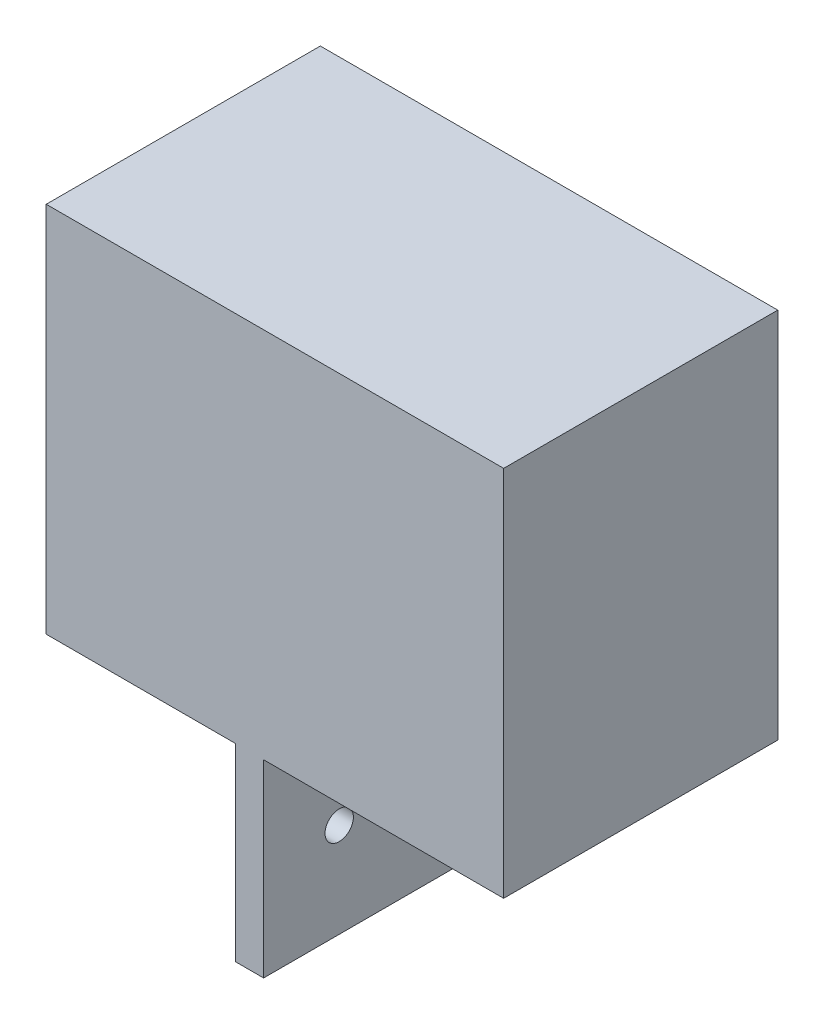
ISO-10303-21;
HEADER;
FILE_DESCRIPTION(('STEP AP214'),'2;1');
FILE_NAME('part.step','',(''),(''),'','','');
FILE_SCHEMA(('AUTOMOTIVE_DESIGN { 1 0 10303 214 1 1 1 1 }'));
ENDSEC;
DATA;
#1=APPLICATION_CONTEXT('core data for automotive mechanical design processes');
#2=APPLICATION_PROTOCOL_DEFINITION('international standard','automotive_design',2000,#1);
#3=PRODUCT_CONTEXT('',#1,'mechanical');
#4=PRODUCT('Part','Part','',(#3));
#5=PRODUCT_RELATED_PRODUCT_CATEGORY('part','',(#4));
#6=PRODUCT_DEFINITION_FORMATION('','',#4);
#7=PRODUCT_DEFINITION_CONTEXT('part definition',#1,'design');
#8=PRODUCT_DEFINITION('design','',#6,#7);
#9=PRODUCT_DEFINITION_SHAPE('','',#8);
#10=(LENGTH_UNIT() NAMED_UNIT(*) SI_UNIT(.MILLI.,.METRE.));
#11=(NAMED_UNIT(*) PLANE_ANGLE_UNIT() SI_UNIT($,.RADIAN.));
#12=(NAMED_UNIT(*) SI_UNIT($,.STERADIAN.) SOLID_ANGLE_UNIT());
#13=UNCERTAINTY_MEASURE_WITH_UNIT(LENGTH_MEASURE(1.E-05),#10,'distance_accuracy_value','');
#14=(GEOMETRIC_REPRESENTATION_CONTEXT(3) GLOBAL_UNCERTAINTY_ASSIGNED_CONTEXT((#13)) GLOBAL_UNIT_ASSIGNED_CONTEXT((#10,
#11,#12)) REPRESENTATION_CONTEXT('',''));
#15=CARTESIAN_POINT('',(0.,0.,0.));
#16=DIRECTION('',(0.,0.,1.));
#17=DIRECTION('',(1.,0.,0.));
#18=AXIS2_PLACEMENT_3D('',#15,#16,#17);
#19=CARTESIAN_POINT('',(-3.80999999999999,-3.81,34.29));
#20=DIRECTION('',(0.,1.,0.));
#21=DIRECTION('',(0.,0.,1.));
#22=AXIS2_PLACEMENT_3D('',#19,#20,#21);
#23=PLANE('',#22);
#24=DIRECTION('',(0.,0.,-1.));
#25=VECTOR('',#24,1.);
#26=CARTESIAN_POINT('',(8.89,-3.81,62.514160488519));
#27=LINE('',#26,#25);
#28=CARTESIAN_POINT('',(8.89,-3.81,36.83));
#29=VERTEX_POINT('',#28);
#30=CARTESIAN_POINT('',(8.89,-3.81,0.));
#31=VERTEX_POINT('',#30);
#32=EDGE_CURVE('E132',#29,#31,#27,.T.);
#33=ORIENTED_EDGE('',*,*,#32,.F.);
#34=DIRECTION('',(1.,0.,0.));
#35=VECTOR('',#34,1.);
#36=CARTESIAN_POINT('',(-3.81,-3.81,36.83));
#37=LINE('',#36,#35);
#38=CARTESIAN_POINT('',(-16.51,-3.81,36.83));
#39=VERTEX_POINT('',#38);
#40=EDGE_CURVE('E126',#39,#29,#37,.T.);
#41=ORIENTED_EDGE('',*,*,#40,.F.);
#42=DIRECTION('',(0.,0.,-1.));
#43=VECTOR('',#42,1.);
#44=CARTESIAN_POINT('',(-16.51,-3.81,88.4545236685047));
#45=LINE('',#44,#43);
#46=CARTESIAN_POINT('',(-16.51,-3.81,0.));
#47=VERTEX_POINT('',#46);
#48=EDGE_CURVE('E130',#39,#47,#45,.T.);
#49=ORIENTED_EDGE('',*,*,#48,.T.);
#50=DIRECTION('',(1.,0.,0.));
#51=VECTOR('',#50,1.);
#52=CARTESIAN_POINT('',(-3.80999999999999,-3.81,0.));
#53=LINE('',#52,#51);
#54=EDGE_CURVE('E213',#47,#31,#53,.T.);
#55=ORIENTED_EDGE('',*,*,#54,.T.);
#56=EDGE_LOOP('',(#33,#41,#49,#55));
#57=FACE_BOUND('',#56,.T.);
#58=ADVANCED_FACE('F35',(#57),#23,.F.);
#59=CARTESIAN_POINT('',(0.,0.,0.));
#60=DIRECTION('',(0.,0.,1.));
#61=DIRECTION('',(1.,0.,0.));
#62=AXIS2_PLACEMENT_3D('',#59,#60,#61);
#63=PLANE('',#62);
#64=ORIENTED_EDGE('',*,*,#54,.F.);
#65=DIRECTION('',(0.,1.,0.));
#66=VECTOR('',#65,1.);
#67=CARTESIAN_POINT('',(-16.51,-3.81,0.));
#68=LINE('',#67,#66);
#69=CARTESIAN_POINT('',(-16.51,46.228,0.));
#70=VERTEX_POINT('',#69);
#71=EDGE_CURVE('E150',#47,#70,#68,.T.);
#72=ORIENTED_EDGE('',*,*,#71,.T.);
#73=DIRECTION('',(-1.,0.,0.));
#74=VECTOR('',#73,1.);
#75=CARTESIAN_POINT('',(-3.81,46.228,0.));
#76=LINE('',#75,#74);
#77=CARTESIAN_POINT('',(44.958,46.228,0.));
#78=VERTEX_POINT('',#77);
#79=EDGE_CURVE('E217',#78,#70,#76,.T.);
#80=ORIENTED_EDGE('',*,*,#79,.F.);
#81=DIRECTION('',(0.,1.,0.));
#82=VECTOR('',#81,1.);
#83=CARTESIAN_POINT('',(44.958,46.228,0.));
#84=LINE('',#83,#82);
#85=CARTESIAN_POINT('',(44.958,-3.81,0.));
#86=VERTEX_POINT('',#85);
#87=EDGE_CURVE('E215',#86,#78,#84,.T.);
#88=ORIENTED_EDGE('',*,*,#87,.F.);
#89=CARTESIAN_POINT('',(12.7,-3.81,0.));
#90=VERTEX_POINT('',#89);
#91=EDGE_CURVE('E212',#90,#86,#53,.T.);
#92=ORIENTED_EDGE('',*,*,#91,.F.);
#93=DIRECTION('',(0.,-1.,0.));
#94=VECTOR('',#93,1.);
#95=CARTESIAN_POINT('',(12.7,-3.81,0.));
#96=LINE('',#95,#94);
#97=CARTESIAN_POINT('',(12.7,-29.21,0.));
#98=VERTEX_POINT('',#97);
#99=EDGE_CURVE('E50',#90,#98,#96,.T.);
#100=ORIENTED_EDGE('',*,*,#99,.T.);
#101=DIRECTION('',(-1.,0.,0.));
#102=VECTOR('',#101,1.);
#103=CARTESIAN_POINT('',(12.7,-29.21,0.));
#104=LINE('',#103,#102);
#105=CARTESIAN_POINT('',(8.89,-29.21,0.));
#106=VERTEX_POINT('',#105);
#107=EDGE_CURVE('E160',#98,#106,#104,.T.);
#108=ORIENTED_EDGE('',*,*,#107,.T.);
#109=DIRECTION('',(0.,1.,0.));
#110=VECTOR('',#109,1.);
#111=CARTESIAN_POINT('',(8.89,-3.81,0.));
#112=LINE('',#111,#110);
#113=EDGE_CURVE('E156',#106,#31,#112,.T.);
#114=ORIENTED_EDGE('',*,*,#113,.T.);
#115=EDGE_LOOP('',(#64,#72,#80,#88,#92,#100,#108,#114));
#116=FACE_BOUND('',#115,.T.);
#117=DIRECTION('',(0.,-1.,0.));
#118=VECTOR('',#117,1.);
#119=CARTESIAN_POINT('',(0.,0.,0.));
#120=LINE('',#119,#118);
#121=CARTESIAN_POINT('',(0.,42.418,0.));
#122=VERTEX_POINT('',#121);
#123=CARTESIAN_POINT('',(0.,0.,0.));
#124=VERTEX_POINT('',#123);
#125=EDGE_CURVE('E180',#122,#124,#120,.T.);
#126=ORIENTED_EDGE('',*,*,#125,.T.);
#127=DIRECTION('',(1.,0.,0.));
#128=VECTOR('',#127,1.);
#129=CARTESIAN_POINT('',(0.,0.,0.));
#130=LINE('',#129,#128);
#131=CARTESIAN_POINT('',(42.418,0.,0.));
#132=VERTEX_POINT('',#131);
#133=EDGE_CURVE('E195',#124,#132,#130,.T.);
#134=ORIENTED_EDGE('',*,*,#133,.T.);
#135=DIRECTION('',(0.,1.,0.));
#136=VECTOR('',#135,1.);
#137=CARTESIAN_POINT('',(42.418,0.,0.));
#138=LINE('',#137,#136);
#139=CARTESIAN_POINT('',(42.418,42.418,0.));
#140=VERTEX_POINT('',#139);
#141=EDGE_CURVE('E198',#132,#140,#138,.T.);
#142=ORIENTED_EDGE('',*,*,#141,.T.);
#143=DIRECTION('',(-1.,0.,0.));
#144=VECTOR('',#143,1.);
#145=CARTESIAN_POINT('',(0.,42.418,0.));
#146=LINE('',#145,#144);
#147=EDGE_CURVE('E185',#140,#122,#146,.T.);
#148=ORIENTED_EDGE('',*,*,#147,.T.);
#149=EDGE_LOOP('',(#126,#134,#142,#148));
#150=FACE_BOUND('',#149,.T.);
#151=ADVANCED_FACE('F226',(#116,#150),#63,.F.);
#152=CARTESIAN_POINT('',(12.7,-3.81,36.83));
#153=VERTEX_POINT('',#152);
#154=CARTESIAN_POINT('',(44.958,-3.81,36.83));
#155=VERTEX_POINT('',#154);
#156=EDGE_CURVE('E135',#153,#155,#37,.T.);
#157=ORIENTED_EDGE('',*,*,#156,.F.);
#158=DIRECTION('',(0.,0.,-1.));
#159=VECTOR('',#158,1.);
#160=CARTESIAN_POINT('',(12.7,-3.81,62.514160488519));
#161=LINE('',#160,#159);
#162=EDGE_CURVE('E171',#153,#90,#161,.T.);
#163=ORIENTED_EDGE('',*,*,#162,.T.);
#164=ORIENTED_EDGE('',*,*,#91,.T.);
#165=DIRECTION('',(0.,0.,-1.));
#166=VECTOR('',#165,1.);
#167=CARTESIAN_POINT('',(44.958,-3.81,34.29));
#168=LINE('',#167,#166);
#169=EDGE_CURVE('E11',#155,#86,#168,.T.);
#170=ORIENTED_EDGE('',*,*,#169,.F.);
#171=EDGE_LOOP('',(#157,#163,#164,#170));
#172=FACE_BOUND('',#171,.T.);
#173=ADVANCED_FACE('F37',(#172),#23,.F.);
#174=CARTESIAN_POINT('',(44.958,46.228,34.29));
#175=DIRECTION('',(-1.,0.,0.));
#176=DIRECTION('',(0.,-1.,0.));
#177=AXIS2_PLACEMENT_3D('',#174,#175,#176);
#178=PLANE('',#177);
#179=ORIENTED_EDGE('',*,*,#87,.T.);
#180=DIRECTION('',(0.,0.,-1.));
#181=VECTOR('',#180,1.);
#182=CARTESIAN_POINT('',(44.958,46.228,34.29));
#183=LINE('',#182,#181);
#184=CARTESIAN_POINT('',(44.958,46.228,36.83));
#185=VERTEX_POINT('',#184);
#186=EDGE_CURVE('E43',#185,#78,#183,.T.);
#187=ORIENTED_EDGE('',*,*,#186,.F.);
#188=DIRECTION('',(0.,1.,0.));
#189=VECTOR('',#188,1.);
#190=CARTESIAN_POINT('',(44.958,46.228,36.83));
#191=LINE('',#190,#189);
#192=EDGE_CURVE('E134',#155,#185,#191,.T.);
#193=ORIENTED_EDGE('',*,*,#192,.F.);
#194=ORIENTED_EDGE('',*,*,#169,.T.);
#195=EDGE_LOOP('',(#179,#187,#193,#194));
#196=FACE_BOUND('',#195,.T.);
#197=ADVANCED_FACE('F241',(#196),#178,.F.);
#198=CARTESIAN_POINT('',(-3.81,46.228,34.29));
#199=DIRECTION('',(0.,-1.,0.));
#200=DIRECTION('',(0.,0.,-1.));
#201=AXIS2_PLACEMENT_3D('',#198,#199,#200);
#202=PLANE('',#201);
#203=ORIENTED_EDGE('',*,*,#79,.T.);
#204=DIRECTION('',(0.,0.,-1.));
#205=VECTOR('',#204,1.);
#206=CARTESIAN_POINT('',(-16.51,46.228,88.4545236685047));
#207=LINE('',#206,#205);
#208=CARTESIAN_POINT('',(-16.51,46.228,36.83));
#209=VERTEX_POINT('',#208);
#210=EDGE_CURVE('E146',#209,#70,#207,.T.);
#211=ORIENTED_EDGE('',*,*,#210,.F.);
#212=DIRECTION('',(-1.,0.,0.));
#213=VECTOR('',#212,1.);
#214=CARTESIAN_POINT('',(-3.81,46.228,36.83));
#215=LINE('',#214,#213);
#216=EDGE_CURVE('E142',#185,#209,#215,.T.);
#217=ORIENTED_EDGE('',*,*,#216,.F.);
#218=ORIENTED_EDGE('',*,*,#186,.T.);
#219=EDGE_LOOP('',(#203,#211,#217,#218));
#220=FACE_BOUND('',#219,.T.);
#221=ADVANCED_FACE('F221',(#220),#202,.F.);
#222=CARTESIAN_POINT('',(0.,0.,34.29));
#223=DIRECTION('',(1.,0.,0.));
#224=DIRECTION('',(0.,0.,-1.));
#225=AXIS2_PLACEMENT_3D('',#222,#223,#224);
#226=PLANE('',#225);
#227=ORIENTED_EDGE('',*,*,#125,.F.);
#228=DIRECTION('',(0.,0.,-1.));
#229=VECTOR('',#228,1.);
#230=CARTESIAN_POINT('',(0.,42.418,34.29));
#231=LINE('',#230,#229);
#232=CARTESIAN_POINT('',(0.,42.418,34.29));
#233=VERTEX_POINT('',#232);
#234=EDGE_CURVE('E192',#233,#122,#231,.T.);
#235=ORIENTED_EDGE('',*,*,#234,.F.);
#236=DIRECTION('',(0.,-1.,0.));
#237=VECTOR('',#236,1.);
#238=CARTESIAN_POINT('',(0.,0.,34.29));
#239=LINE('',#238,#237);
#240=CARTESIAN_POINT('',(0.,0.,34.29));
#241=VERTEX_POINT('',#240);
#242=EDGE_CURVE('E181',#233,#241,#239,.T.);
#243=ORIENTED_EDGE('',*,*,#242,.T.);
#244=DIRECTION('',(0.,0.,-1.));
#245=VECTOR('',#244,1.);
#246=CARTESIAN_POINT('',(0.,0.,34.29));
#247=LINE('',#246,#245);
#248=EDGE_CURVE('E209',#241,#124,#247,.T.);
#249=ORIENTED_EDGE('',*,*,#248,.T.);
#250=EDGE_LOOP('',(#227,#235,#243,#249));
#251=FACE_BOUND('',#250,.T.);
#252=ADVANCED_FACE('F247',(#251),#226,.T.);
#253=CARTESIAN_POINT('',(0.,0.,34.29));
#254=DIRECTION('',(0.,1.,0.));
#255=DIRECTION('',(0.,0.,1.));
#256=AXIS2_PLACEMENT_3D('',#253,#254,#255);
#257=PLANE('',#256);
#258=ORIENTED_EDGE('',*,*,#133,.F.);
#259=ORIENTED_EDGE('',*,*,#248,.F.);
#260=DIRECTION('',(1.,0.,0.));
#261=VECTOR('',#260,1.);
#262=CARTESIAN_POINT('',(0.,0.,34.29));
#263=LINE('',#262,#261);
#264=CARTESIAN_POINT('',(42.418,0.,34.29));
#265=VERTEX_POINT('',#264);
#266=EDGE_CURVE('E184',#241,#265,#263,.T.);
#267=ORIENTED_EDGE('',*,*,#266,.T.);
#268=DIRECTION('',(0.,0.,-1.));
#269=VECTOR('',#268,1.);
#270=CARTESIAN_POINT('',(42.418,0.,34.29));
#271=LINE('',#270,#269);
#272=EDGE_CURVE('E207',#265,#132,#271,.T.);
#273=ORIENTED_EDGE('',*,*,#272,.T.);
#274=EDGE_LOOP('',(#258,#259,#267,#273));
#275=FACE_BOUND('',#274,.T.);
#276=ADVANCED_FACE('F259',(#275),#257,.T.);
#277=CARTESIAN_POINT('',(42.418,0.,34.29));
#278=DIRECTION('',(-1.,0.,0.));
#279=DIRECTION('',(0.,0.,1.));
#280=AXIS2_PLACEMENT_3D('',#277,#278,#279);
#281=PLANE('',#280);
#282=ORIENTED_EDGE('',*,*,#141,.F.);
#283=ORIENTED_EDGE('',*,*,#272,.F.);
#284=DIRECTION('',(0.,1.,0.));
#285=VECTOR('',#284,1.);
#286=CARTESIAN_POINT('',(42.418,0.,34.29));
#287=LINE('',#286,#285);
#288=CARTESIAN_POINT('',(42.418,42.418,34.29));
#289=VERTEX_POINT('',#288);
#290=EDGE_CURVE('E188',#265,#289,#287,.T.);
#291=ORIENTED_EDGE('',*,*,#290,.T.);
#292=DIRECTION('',(0.,0.,-1.));
#293=VECTOR('',#292,1.);
#294=CARTESIAN_POINT('',(42.418,42.418,34.29));
#295=LINE('',#294,#293);
#296=EDGE_CURVE('E205',#289,#140,#295,.T.);
#297=ORIENTED_EDGE('',*,*,#296,.T.);
#298=EDGE_LOOP('',(#282,#283,#291,#297));
#299=FACE_BOUND('',#298,.T.);
#300=ADVANCED_FACE('F263',(#299),#281,.T.);
#301=CARTESIAN_POINT('',(0.,42.418,34.29));
#302=DIRECTION('',(0.,-1.,0.));
#303=DIRECTION('',(0.,0.,-1.));
#304=AXIS2_PLACEMENT_3D('',#301,#302,#303);
#305=PLANE('',#304);
#306=ORIENTED_EDGE('',*,*,#147,.F.);
#307=ORIENTED_EDGE('',*,*,#296,.F.);
#308=DIRECTION('',(-1.,0.,0.));
#309=VECTOR('',#308,1.);
#310=CARTESIAN_POINT('',(0.,42.418,34.29));
#311=LINE('',#310,#309);
#312=EDGE_CURVE('E58',#289,#233,#311,.T.);
#313=ORIENTED_EDGE('',*,*,#312,.T.);
#314=ORIENTED_EDGE('',*,*,#234,.T.);
#315=EDGE_LOOP('',(#306,#307,#313,#314));
#316=FACE_BOUND('',#315,.T.);
#317=ADVANCED_FACE('F267',(#316),#305,.T.);
#318=CARTESIAN_POINT('',(0.,0.,34.29));
#319=DIRECTION('',(0.,0.,1.));
#320=DIRECTION('',(1.,0.,0.));
#321=AXIS2_PLACEMENT_3D('',#318,#319,#320);
#322=PLANE('',#321);
#323=ORIENTED_EDGE('',*,*,#266,.F.);
#324=ORIENTED_EDGE('',*,*,#242,.F.);
#325=ORIENTED_EDGE('',*,*,#312,.F.);
#326=ORIENTED_EDGE('',*,*,#290,.F.);
#327=EDGE_LOOP('',(#323,#324,#325,#326));
#328=FACE_BOUND('',#327,.T.);
#329=ADVANCED_FACE('F271',(#328),#322,.F.);
#330=CARTESIAN_POINT('',(0.,0.,36.83));
#331=DIRECTION('',(0.,0.,1.));
#332=DIRECTION('',(1.,0.,0.));
#333=AXIS2_PLACEMENT_3D('',#330,#331,#332);
#334=PLANE('',#333);
#335=ORIENTED_EDGE('',*,*,#216,.T.);
#336=DIRECTION('',(0.,1.,0.));
#337=VECTOR('',#336,1.);
#338=CARTESIAN_POINT('',(-16.51,-3.81,36.83));
#339=LINE('',#338,#337);
#340=EDGE_CURVE('E138',#39,#209,#339,.T.);
#341=ORIENTED_EDGE('',*,*,#340,.F.);
#342=ORIENTED_EDGE('',*,*,#40,.T.);
#343=DIRECTION('',(0.,1.,0.));
#344=VECTOR('',#343,1.);
#345=CARTESIAN_POINT('',(8.89,-3.81,36.83));
#346=LINE('',#345,#344);
#347=CARTESIAN_POINT('',(8.89,-29.21,36.83));
#348=VERTEX_POINT('',#347);
#349=EDGE_CURVE('E172',#348,#29,#346,.T.);
#350=ORIENTED_EDGE('',*,*,#349,.F.);
#351=DIRECTION('',(-1.,0.,0.));
#352=VECTOR('',#351,1.);
#353=CARTESIAN_POINT('',(12.7,-29.21,36.83));
#354=LINE('',#353,#352);
#355=CARTESIAN_POINT('',(12.7,-29.21,36.83));
#356=VERTEX_POINT('',#355);
#357=EDGE_CURVE('E159',#356,#348,#354,.T.);
#358=ORIENTED_EDGE('',*,*,#357,.F.);
#359=DIRECTION('',(0.,-1.,0.));
#360=VECTOR('',#359,1.);
#361=CARTESIAN_POINT('',(12.7,-3.81,36.83));
#362=LINE('',#361,#360);
#363=EDGE_CURVE('E167',#153,#356,#362,.T.);
#364=ORIENTED_EDGE('',*,*,#363,.F.);
#365=ORIENTED_EDGE('',*,*,#156,.T.);
#366=ORIENTED_EDGE('',*,*,#192,.T.);
#367=EDGE_LOOP('',(#335,#341,#342,#350,#358,#364,#365,#366));
#368=FACE_BOUND('',#367,.T.);
#369=ADVANCED_FACE('F139',(#368),#334,.T.);
#370=CARTESIAN_POINT('',(12.7,-29.21,62.514160488519));
#371=DIRECTION('',(0.,-1.,0.));
#372=DIRECTION('',(1.,0.,0.));
#373=AXIS2_PLACEMENT_3D('',#370,#371,#372);
#374=PLANE('',#373);
#375=DIRECTION('',(0.,0.,-1.));
#376=VECTOR('',#375,1.);
#377=CARTESIAN_POINT('',(12.7,-29.21,62.514160488519));
#378=LINE('',#377,#376);
#379=EDGE_CURVE('E170',#356,#98,#378,.T.);
#380=ORIENTED_EDGE('',*,*,#379,.F.);
#381=ORIENTED_EDGE('',*,*,#357,.T.);
#382=DIRECTION('',(0.,0.,-1.));
#383=VECTOR('',#382,1.);
#384=CARTESIAN_POINT('',(8.89,-29.21,62.514160488519));
#385=LINE('',#384,#383);
#386=EDGE_CURVE('E166',#348,#106,#385,.T.);
#387=ORIENTED_EDGE('',*,*,#386,.T.);
#388=ORIENTED_EDGE('',*,*,#107,.F.);
#389=EDGE_LOOP('',(#380,#381,#387,#388));
#390=FACE_BOUND('',#389,.T.);
#391=ADVANCED_FACE('F238',(#390),#374,.T.);
#392=CARTESIAN_POINT('',(8.89,-3.81,62.514160488519));
#393=DIRECTION('',(-1.,0.,0.));
#394=DIRECTION('',(0.,-1.,0.));
#395=AXIS2_PLACEMENT_3D('',#392,#393,#394);
#396=PLANE('',#395);
#397=CARTESIAN_POINT('',(8.89,-16.51,26.67));
#398=DIRECTION('',(-1.,0.,0.));
#399=DIRECTION('',(0.,-1.,0.));
#400=AXIS2_PLACEMENT_3D('',#397,#398,#399);
#401=CIRCLE('',#400,1.905);
#402=CARTESIAN_POINT('',(8.89,-18.415,26.67));
#403=VERTEX_POINT('',#402);
#404=EDGE_CURVE('E152',#403,#403,#401,.T.);
#405=ORIENTED_EDGE('',*,*,#404,.F.);
#406=EDGE_LOOP('',(#405));
#407=FACE_BOUND('',#406,.T.);
#408=CARTESIAN_POINT('',(8.89,-16.51,10.16));
#409=DIRECTION('',(-1.,0.,0.));
#410=DIRECTION('',(0.,-1.,0.));
#411=AXIS2_PLACEMENT_3D('',#408,#409,#410);
#412=CIRCLE('',#411,1.905);
#413=CARTESIAN_POINT('',(8.89,-18.415,10.16));
#414=VERTEX_POINT('',#413);
#415=EDGE_CURVE('E302',#414,#414,#412,.T.);
#416=ORIENTED_EDGE('',*,*,#415,.F.);
#417=EDGE_LOOP('',(#416));
#418=FACE_BOUND('',#417,.T.);
#419=ORIENTED_EDGE('',*,*,#386,.F.);
#420=ORIENTED_EDGE('',*,*,#349,.T.);
#421=ORIENTED_EDGE('',*,*,#32,.T.);
#422=ORIENTED_EDGE('',*,*,#113,.F.);
#423=EDGE_LOOP('',(#419,#420,#421,#422));
#424=FACE_BOUND('',#423,.T.);
#425=ADVANCED_FACE('F233',(#407,#418,#424),#396,.T.);
#426=CARTESIAN_POINT('',(12.7,-3.81,62.514160488519));
#427=DIRECTION('',(1.,0.,0.));
#428=DIRECTION('',(0.,1.,0.));
#429=AXIS2_PLACEMENT_3D('',#426,#427,#428);
#430=PLANE('',#429);
#431=CARTESIAN_POINT('',(12.7,-16.51,26.67));
#432=DIRECTION('',(1.,0.,0.));
#433=DIRECTION('',(0.,1.,0.));
#434=AXIS2_PLACEMENT_3D('',#431,#432,#433);
#435=CIRCLE('',#434,1.905);
#436=CARTESIAN_POINT('',(12.7,-14.605,26.67));
#437=VERTEX_POINT('',#436);
#438=EDGE_CURVE('E301',#437,#437,#435,.T.);
#439=ORIENTED_EDGE('',*,*,#438,.F.);
#440=EDGE_LOOP('',(#439));
#441=FACE_BOUND('',#440,.T.);
#442=CARTESIAN_POINT('',(12.7,-16.51,10.16));
#443=DIRECTION('',(1.,0.,0.));
#444=DIRECTION('',(0.,1.,0.));
#445=AXIS2_PLACEMENT_3D('',#442,#443,#444);
#446=CIRCLE('',#445,1.905);
#447=CARTESIAN_POINT('',(12.7,-14.605,10.16));
#448=VERTEX_POINT('',#447);
#449=EDGE_CURVE('E303',#448,#448,#446,.T.);
#450=ORIENTED_EDGE('',*,*,#449,.F.);
#451=EDGE_LOOP('',(#450));
#452=FACE_BOUND('',#451,.T.);
#453=ORIENTED_EDGE('',*,*,#162,.F.);
#454=ORIENTED_EDGE('',*,*,#363,.T.);
#455=ORIENTED_EDGE('',*,*,#379,.T.);
#456=ORIENTED_EDGE('',*,*,#99,.F.);
#457=EDGE_LOOP('',(#453,#454,#455,#456));
#458=FACE_BOUND('',#457,.T.);
#459=ADVANCED_FACE('F236',(#441,#452,#458),#430,.T.);
#460=CARTESIAN_POINT('',(-16.51,-3.81,88.4545236685047));
#461=DIRECTION('',(-1.,0.,0.));
#462=DIRECTION('',(0.,0.,1.));
#463=AXIS2_PLACEMENT_3D('',#460,#461,#462);
#464=PLANE('',#463);
#465=ORIENTED_EDGE('',*,*,#48,.F.);
#466=ORIENTED_EDGE('',*,*,#340,.T.);
#467=ORIENTED_EDGE('',*,*,#210,.T.);
#468=ORIENTED_EDGE('',*,*,#71,.F.);
#469=EDGE_LOOP('',(#465,#466,#467,#468));
#470=FACE_BOUND('',#469,.T.);
#471=ADVANCED_FACE('F148',(#470),#464,.T.);
#472=CARTESIAN_POINT('',(-16.51,-16.51,10.16));
#473=DIRECTION('',(1.,0.,0.));
#474=DIRECTION('',(0.,1.,0.));
#475=AXIS2_PLACEMENT_3D('',#472,#473,#474);
#476=CYLINDRICAL_SURFACE('',#475,1.905);
#477=ORIENTED_EDGE('',*,*,#415,.T.);
#478=EDGE_LOOP('',(#477));
#479=FACE_BOUND('',#478,.T.);
#480=ORIENTED_EDGE('',*,*,#449,.T.);
#481=EDGE_LOOP('',(#480));
#482=FACE_BOUND('',#481,.T.);
#483=ADVANCED_FACE('F287',(#479,#482),#476,.F.);
#484=CARTESIAN_POINT('',(-16.51,-16.51,26.67));
#485=DIRECTION('',(1.,0.,0.));
#486=DIRECTION('',(0.,1.,0.));
#487=AXIS2_PLACEMENT_3D('',#484,#485,#486);
#488=CYLINDRICAL_SURFACE('',#487,1.905);
#489=ORIENTED_EDGE('',*,*,#404,.T.);
#490=EDGE_LOOP('',(#489));
#491=FACE_BOUND('',#490,.T.);
#492=ORIENTED_EDGE('',*,*,#438,.T.);
#493=EDGE_LOOP('',(#492));
#494=FACE_BOUND('',#493,.T.);
#495=ADVANCED_FACE('F290',(#491,#494),#488,.F.);
#496=CLOSED_SHELL('',(#58,#151,#173,#197,#221,#252,#276,#300,#317,#329,#369,#391,#425,#459,#471,
#483,#495));
#497=MANIFOLD_SOLID_BREP('B2',#496);
#498=ADVANCED_BREP_SHAPE_REPRESENTATION('',(#18,#497),#14);
#499=SHAPE_DEFINITION_REPRESENTATION(#9,#498);
ENDSEC;
END-ISO-10303-21;
